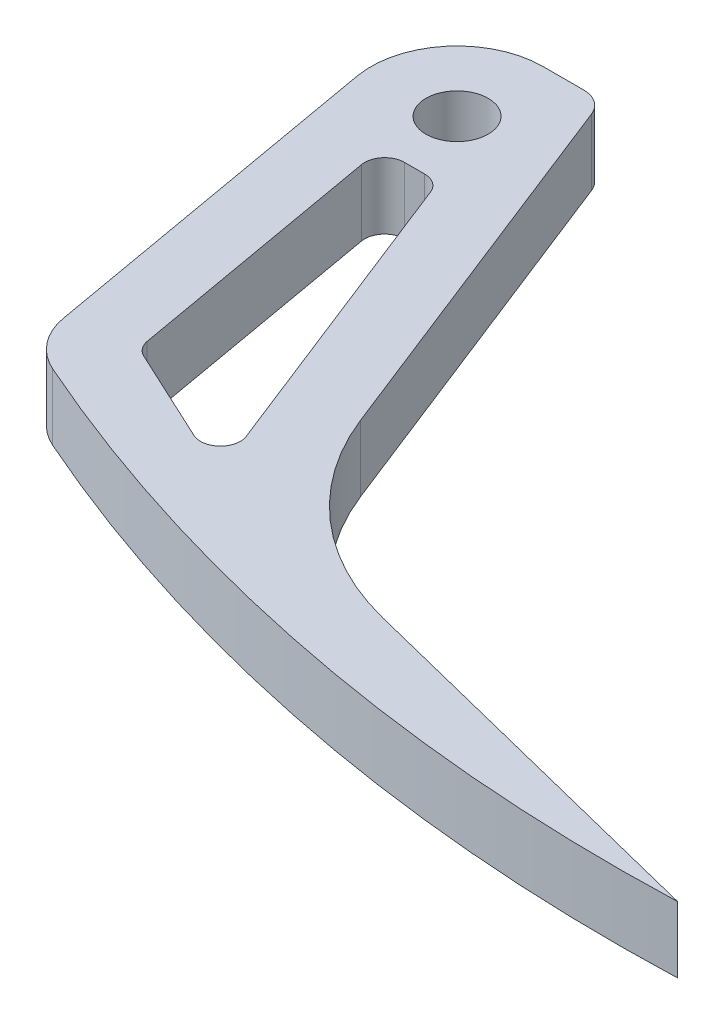
ISO-10303-21;
HEADER;
FILE_DESCRIPTION(('STEP AP214'),'2;1');
FILE_NAME('part.step','',(''),(''),'','','');
FILE_SCHEMA(('AUTOMOTIVE_DESIGN { 1 0 10303 214 1 1 1 1 }'));
ENDSEC;
DATA;
#1=APPLICATION_CONTEXT('core data for automotive mechanical design processes');
#2=APPLICATION_PROTOCOL_DEFINITION('international standard','automotive_design',2000,#1);
#3=PRODUCT_CONTEXT('',#1,'mechanical');
#4=PRODUCT('Part','Part','',(#3));
#5=PRODUCT_RELATED_PRODUCT_CATEGORY('part','',(#4));
#6=PRODUCT_DEFINITION_FORMATION('','',#4);
#7=PRODUCT_DEFINITION_CONTEXT('part definition',#1,'design');
#8=PRODUCT_DEFINITION('design','',#6,#7);
#9=PRODUCT_DEFINITION_SHAPE('','',#8);
#10=(LENGTH_UNIT() NAMED_UNIT(*) SI_UNIT(.MILLI.,.METRE.));
#11=(NAMED_UNIT(*) PLANE_ANGLE_UNIT() SI_UNIT($,.RADIAN.));
#12=(NAMED_UNIT(*) SI_UNIT($,.STERADIAN.) SOLID_ANGLE_UNIT());
#13=UNCERTAINTY_MEASURE_WITH_UNIT(LENGTH_MEASURE(1.E-05),#10,'distance_accuracy_value','');
#14=(GEOMETRIC_REPRESENTATION_CONTEXT(3) GLOBAL_UNCERTAINTY_ASSIGNED_CONTEXT((#13)) GLOBAL_UNIT_ASSIGNED_CONTEXT((#10,
#11,#12)) REPRESENTATION_CONTEXT('',''));
#15=CARTESIAN_POINT('',(0.,0.,0.));
#16=DIRECTION('',(0.,0.,1.));
#17=DIRECTION('',(1.,0.,0.));
#18=AXIS2_PLACEMENT_3D('',#15,#16,#17);
#19=CARTESIAN_POINT('',(7.68240809314638,6.35,-3.02086591730899));
#20=DIRECTION('',(0.930636958588295,0.,-0.365943781624348));
#21=DIRECTION('',(-0.365943781624348,0.,-0.930636958588295));
#22=AXIS2_PLACEMENT_3D('',#19,#20,#21);
#23=PLANE('',#22);
#24=DIRECTION('',(0.365943781624348,0.,0.930636958588295));
#25=VECTOR('',#24,1.);
#26=CARTESIAN_POINT('',(7.68240809314638,0.,-3.02086591730899));
#27=LINE('',#26,#25);
#28=CARTESIAN_POINT('',(6.25752879460584,0.,-6.64449720532584));
#29=VERTEX_POINT('',#28);
#30=CARTESIAN_POINT('',(20.6129718324001,0.,29.863038975722));
#31=VERTEX_POINT('',#30);
#32=EDGE_CURVE('E196',#29,#31,#27,.T.);
#33=ORIENTED_EDGE('',*,*,#32,.F.);
#34=DIRECTION('',(0.,-1.,0.));
#35=VECTOR('',#34,1.);
#36=CARTESIAN_POINT('',(6.25752879460584,6.35,-6.64449720532584));
#37=LINE('',#36,#35);
#38=CARTESIAN_POINT('',(6.25752879460584,6.35,-6.64449720532584));
#39=VERTEX_POINT('',#38);
#40=EDGE_CURVE('E46',#29,#39,#37,.F.);
#41=ORIENTED_EDGE('',*,*,#40,.T.);
#42=DIRECTION('',(0.365943781624348,0.,0.930636958588295));
#43=VECTOR('',#42,1.);
#44=CARTESIAN_POINT('',(7.68240809314638,6.35,-3.02086591730899));
#45=LINE('',#44,#43);
#46=CARTESIAN_POINT('',(20.6129718324001,6.35,29.863038975722));
#47=VERTEX_POINT('',#46);
#48=EDGE_CURVE('E180',#39,#47,#45,.T.);
#49=ORIENTED_EDGE('',*,*,#48,.T.);
#50=DIRECTION('',(0.,-1.,0.));
#51=VECTOR('',#50,1.);
#52=CARTESIAN_POINT('',(20.6129718324001,0.,29.863038975722));
#53=LINE('',#52,#51);
#54=EDGE_CURVE('E165',#47,#31,#53,.T.);
#55=ORIENTED_EDGE('',*,*,#54,.T.);
#56=EDGE_LOOP('',(#33,#41,#49,#55));
#57=FACE_BOUND('',#56,.T.);
#58=ADVANCED_FACE('F38',(#57),#23,.T.);
#59=CARTESIAN_POINT('',(0.,6.35,-8.255));
#60=DIRECTION('',(0.,0.,-1.));
#61=DIRECTION('',(-1.,0.,0.));
#62=AXIS2_PLACEMENT_3D('',#59,#60,#61);
#63=PLANE('',#62);
#64=DIRECTION('',(1.,0.,0.));
#65=VECTOR('',#64,1.);
#66=CARTESIAN_POINT('',(0.,6.35,-8.255));
#67=LINE('',#66,#65);
#68=CARTESIAN_POINT('',(0.,6.35,-8.255));
#69=VERTEX_POINT('',#68);
#70=CARTESIAN_POINT('',(3.89371091979157,6.35,-8.255));
#71=VERTEX_POINT('',#70);
#72=EDGE_CURVE('E160',#69,#71,#67,.T.);
#73=ORIENTED_EDGE('',*,*,#72,.T.);
#74=DIRECTION('',(0.,-1.,0.));
#75=VECTOR('',#74,1.);
#76=CARTESIAN_POINT('',(3.89371091979157,6.35,-8.255));
#77=LINE('',#76,#75);
#78=CARTESIAN_POINT('',(3.89371091979157,0.,-8.255));
#79=VERTEX_POINT('',#78);
#80=EDGE_CURVE('E269',#71,#79,#77,.T.);
#81=ORIENTED_EDGE('',*,*,#80,.T.);
#82=DIRECTION('',(1.,0.,0.));
#83=VECTOR('',#82,1.);
#84=CARTESIAN_POINT('',(0.,0.,-8.255));
#85=LINE('',#84,#83);
#86=CARTESIAN_POINT('',(0.,0.,-8.255));
#87=VERTEX_POINT('',#86);
#88=EDGE_CURVE('E162',#87,#79,#85,.T.);
#89=ORIENTED_EDGE('',*,*,#88,.F.);
#90=DIRECTION('',(0.,-1.,0.));
#91=VECTOR('',#90,1.);
#92=CARTESIAN_POINT('',(0.,6.35,-8.255));
#93=LINE('',#92,#91);
#94=EDGE_CURVE('E155',#69,#87,#93,.T.);
#95=ORIENTED_EDGE('',*,*,#94,.F.);
#96=EDGE_LOOP('',(#73,#81,#89,#95));
#97=FACE_BOUND('',#96,.T.);
#98=ADVANCED_FACE('F157',(#97),#63,.T.);
#99=CARTESIAN_POINT('',(0.,6.35,0.));
#100=DIRECTION('',(0.,-1.,0.));
#101=DIRECTION('',(0.,0.,-1.));
#102=AXIS2_PLACEMENT_3D('',#99,#100,#101);
#103=CYLINDRICAL_SURFACE('',#102,8.255);
#104=CARTESIAN_POINT('',(0.,0.,0.));
#105=DIRECTION('',(0.,1.,0.));
#106=DIRECTION('',(0.,0.,1.));
#107=AXIS2_PLACEMENT_3D('',#104,#105,#106);
#108=CIRCLE('',#107,8.255);
#109=CARTESIAN_POINT('',(-8.12958800111578,0.,1.43346570664052));
#110=VERTEX_POINT('',#109);
#111=EDGE_CURVE('E200',#87,#110,#108,.T.);
#112=ORIENTED_EDGE('',*,*,#111,.T.);
#113=DIRECTION('',(0.,-1.,0.));
#114=VECTOR('',#113,1.);
#115=CARTESIAN_POINT('',(-8.12958800111578,6.35,1.43346570664052));
#116=LINE('',#115,#114);
#117=CARTESIAN_POINT('',(-8.12958800111578,6.35,1.43346570664052));
#118=VERTEX_POINT('',#117);
#119=EDGE_CURVE('E166',#118,#110,#116,.T.);
#120=ORIENTED_EDGE('',*,*,#119,.F.);
#121=CARTESIAN_POINT('',(0.,6.35,0.));
#122=DIRECTION('',(0.,1.,0.));
#123=DIRECTION('',(0.,0.,1.));
#124=AXIS2_PLACEMENT_3D('',#121,#122,#123);
#125=CIRCLE('',#124,8.255);
#126=EDGE_CURVE('E169',#69,#118,#125,.T.);
#127=ORIENTED_EDGE('',*,*,#126,.F.);
#128=ORIENTED_EDGE('',*,*,#94,.T.);
#129=EDGE_LOOP('',(#112,#120,#127,#128));
#130=FACE_BOUND('',#129,.T.);
#131=ADVANCED_FACE('F170',(#130),#103,.T.);
#132=CARTESIAN_POINT('',(-8.12958800111578,6.35,1.43346570664052));
#133=DIRECTION('',(0.984807753012208,0.,-0.173648177666931));
#134=DIRECTION('',(-0.173648177666931,0.,-0.984807753012208));
#135=AXIS2_PLACEMENT_3D('',#132,#133,#134);
#136=PLANE('',#135);
#137=DIRECTION('',(0.173648177666931,0.,0.984807753012208));
#138=VECTOR('',#137,1.);
#139=CARTESIAN_POINT('',(-8.12958800111578,0.,1.43346570664052));
#140=LINE('',#139,#138);
#141=CARTESIAN_POINT('',(-2.09535075071062,0.,35.655325720123));
#142=VERTEX_POINT('',#141);
#143=EDGE_CURVE('E202',#110,#142,#140,.T.);
#144=ORIENTED_EDGE('',*,*,#143,.T.);
#145=DIRECTION('',(0.,-1.,0.));
#146=VECTOR('',#145,1.);
#147=CARTESIAN_POINT('',(-2.09535075071062,6.35,35.655325720123));
#148=LINE('',#147,#146);
#149=CARTESIAN_POINT('',(-2.09535075071062,6.35,35.655325720123));
#150=VERTEX_POINT('',#149);
#151=EDGE_CURVE('E229',#142,#150,#148,.F.);
#152=ORIENTED_EDGE('',*,*,#151,.T.);
#153=DIRECTION('',(0.173648177666931,0.,0.984807753012208));
#154=VECTOR('',#153,1.);
#155=CARTESIAN_POINT('',(-8.12958800111578,6.35,1.43346570664052));
#156=LINE('',#155,#154);
#157=EDGE_CURVE('E175',#118,#150,#156,.T.);
#158=ORIENTED_EDGE('',*,*,#157,.F.);
#159=ORIENTED_EDGE('',*,*,#119,.T.);
#160=EDGE_LOOP('',(#144,#152,#158,#159));
#161=FACE_BOUND('',#160,.T.);
#162=ADVANCED_FACE('F276',(#161),#136,.F.);
#163=CARTESIAN_POINT('',(69.85,6.35,-114.497688236202));
#164=DIRECTION('',(0.,-1.,0.));
#165=DIRECTION('',(0.,0.,-1.));
#166=AXIS2_PLACEMENT_3D('',#163,#164,#165);
#167=CYLINDRICAL_SURFACE('',#166,169.234688236202);
#168=CARTESIAN_POINT('',(69.85,6.35,-114.497688236202));
#169=DIRECTION('',(0.,1.,0.));
#170=DIRECTION('',(0.,0.,1.));
#171=AXIS2_PLACEMENT_3D('',#168,#169,#170);
#172=CIRCLE('',#171,169.234688236202);
#173=CARTESIAN_POINT('',(1.59720684409079,6.35,40.3633330984811));
#174=VERTEX_POINT('',#173);
#175=CARTESIAN_POINT('',(75.7837681621002,6.35,54.632942040525));
#176=VERTEX_POINT('',#175);
#177=EDGE_CURVE('E187',#174,#176,#172,.T.);
#178=ORIENTED_EDGE('',*,*,#177,.F.);
#179=DIRECTION('',(0.,-1.,0.));
#180=VECTOR('',#179,1.);
#181=CARTESIAN_POINT('',(1.59720684409079,6.35,40.3633330984811));
#182=LINE('',#181,#180);
#183=CARTESIAN_POINT('',(1.59720684409079,0.,40.3633330984811));
#184=VERTEX_POINT('',#183);
#185=EDGE_CURVE('E224',#174,#184,#182,.T.);
#186=ORIENTED_EDGE('',*,*,#185,.T.);
#187=CARTESIAN_POINT('',(69.85,0.,-114.497688236202));
#188=DIRECTION('',(0.,1.,0.));
#189=DIRECTION('',(0.,0.,1.));
#190=AXIS2_PLACEMENT_3D('',#187,#188,#189);
#191=CIRCLE('',#190,169.234688236202);
#192=CARTESIAN_POINT('',(75.7837681621002,0.,54.632942040525));
#193=VERTEX_POINT('',#192);
#194=EDGE_CURVE('E205',#184,#193,#191,.T.);
#195=ORIENTED_EDGE('',*,*,#194,.T.);
#196=DIRECTION('',(0.,-1.,0.));
#197=VECTOR('',#196,1.);
#198=CARTESIAN_POINT('',(75.7837681621002,6.35,54.632942040525));
#199=LINE('',#198,#197);
#200=EDGE_CURVE('E195',#176,#193,#199,.T.);
#201=ORIENTED_EDGE('',*,*,#200,.F.);
#202=EDGE_LOOP('',(#178,#186,#195,#201));
#203=FACE_BOUND('',#202,.T.);
#204=ADVANCED_FACE('F285',(#203),#167,.T.);
#205=CARTESIAN_POINT('',(-8.39694117647059,6.35,33.5877647058823));
#206=DIRECTION('',(0.242535625036333,0.,-0.970142500145332));
#207=DIRECTION('',(-0.970142500145332,0.,-0.242535625036333));
#208=AXIS2_PLACEMENT_3D('',#205,#206,#207);
#209=PLANE('',#208);
#210=DIRECTION('',(0.970142500145332,0.,0.242535625036333));
#211=VECTOR('',#210,1.);
#212=CARTESIAN_POINT('',(-8.39694117647059,0.,33.5877647058823));
#213=LINE('',#212,#211);
#214=CARTESIAN_POINT('',(38.0907457046199,0.,45.209686426155));
#215=VERTEX_POINT('',#214);
#216=EDGE_CURVE('E207',#215,#193,#213,.T.);
#217=ORIENTED_EDGE('',*,*,#216,.F.);
#218=DIRECTION('',(0.,-1.,0.));
#219=VECTOR('',#218,1.);
#220=CARTESIAN_POINT('',(38.0907457046199,6.35,45.209686426155));
#221=LINE('',#220,#219);
#222=CARTESIAN_POINT('',(38.0907457046199,6.35,45.209686426155));
#223=VERTEX_POINT('',#222);
#224=EDGE_CURVE('E217',#215,#223,#221,.F.);
#225=ORIENTED_EDGE('',*,*,#224,.T.);
#226=DIRECTION('',(0.970142500145332,0.,0.242535625036333));
#227=VECTOR('',#226,1.);
#228=CARTESIAN_POINT('',(-8.39694117647059,6.35,33.5877647058823));
#229=LINE('',#228,#227);
#230=EDGE_CURVE('E189',#223,#176,#229,.T.);
#231=ORIENTED_EDGE('',*,*,#230,.T.);
#232=ORIENTED_EDGE('',*,*,#200,.T.);
#233=EDGE_LOOP('',(#217,#225,#231,#232));
#234=FACE_BOUND('',#233,.T.);
#235=ADVANCED_FACE('F291',(#234),#209,.T.);
#236=CARTESIAN_POINT('',(0.,6.35,0.));
#237=DIRECTION('',(0.,-1.,0.));
#238=DIRECTION('',(0.,0.,-1.));
#239=AXIS2_PLACEMENT_3D('',#236,#237,#238);
#240=CYLINDRICAL_SURFACE('',#239,2.9845);
#241=CARTESIAN_POINT('',(0.,6.35,0.));
#242=DIRECTION('',(0.,1.,0.));
#243=DIRECTION('',(0.,0.,1.));
#244=AXIS2_PLACEMENT_3D('',#241,#242,#243);
#245=CIRCLE('',#244,2.9845);
#246=CARTESIAN_POINT('',(0.,6.35,2.9845));
#247=VERTEX_POINT('',#246);
#248=EDGE_CURVE('E192',#247,#247,#245,.T.);
#249=ORIENTED_EDGE('',*,*,#248,.T.);
#250=EDGE_LOOP('',(#249));
#251=FACE_BOUND('',#250,.T.);
#252=CARTESIAN_POINT('',(0.,0.,0.));
#253=DIRECTION('',(0.,1.,0.));
#254=DIRECTION('',(0.,0.,1.));
#255=AXIS2_PLACEMENT_3D('',#252,#253,#254);
#256=CIRCLE('',#255,2.9845);
#257=CARTESIAN_POINT('',(0.,0.,2.9845));
#258=VERTEX_POINT('',#257);
#259=EDGE_CURVE('E182',#258,#258,#256,.T.);
#260=ORIENTED_EDGE('',*,*,#259,.F.);
#261=EDGE_LOOP('',(#260));
#262=FACE_BOUND('',#261,.T.);
#263=ADVANCED_FACE('F392',(#251,#262),#240,.F.);
#264=CARTESIAN_POINT('',(0.,6.35,0.));
#265=DIRECTION('',(0.,1.,0.));
#266=DIRECTION('',(0.,0.,1.));
#267=AXIS2_PLACEMENT_3D('',#264,#265,#266);
#268=PLANE('',#267);
#269=DIRECTION('',(-1.,0.,0.));
#270=VECTOR('',#269,1.);
#271=CARTESIAN_POINT('',(-0.959630389308041,6.35,6.35));
#272=LINE('',#271,#270);
#273=CARTESIAN_POINT('',(3.24601971738949,6.35,6.35));
#274=VERTEX_POINT('',#273);
#275=CARTESIAN_POINT('',(1.31066020458393,6.35,6.35));
#276=VERTEX_POINT('',#275);
#277=EDGE_CURVE('E356',#274,#276,#272,.T.);
#278=ORIENTED_EDGE('',*,*,#277,.F.);
#279=CARTESIAN_POINT('',(3.24601971738949,6.35,8.255));
#280=DIRECTION('',(0.,1.,0.));
#281=DIRECTION('',(0.,0.,1.));
#282=AXIS2_PLACEMENT_3D('',#279,#280,#281);
#283=CIRCLE('',#282,1.905);
#284=CARTESIAN_POINT('',(5.01888312350019,6.35,7.55787709600561));
#285=VERTEX_POINT('',#284);
#286=EDGE_CURVE('E261',#274,#285,#283,.F.);
#287=ORIENTED_EDGE('',*,*,#286,.T.);
#288=DIRECTION('',(-0.365943781624347,0.,-0.930636958588295));
#289=VECTOR('',#288,1.);
#290=CARTESIAN_POINT('',(18.2194732646305,6.35,41.1284900627893));
#291=LINE('',#290,#289);
#292=CARTESIAN_POINT('',(16.4762487518267,6.35,36.695270425797));
#293=VERTEX_POINT('',#292);
#294=EDGE_CURVE('E346',#293,#285,#291,.T.);
#295=ORIENTED_EDGE('',*,*,#294,.F.);
#296=CARTESIAN_POINT('',(14.703385345716,6.35,37.3923933297914));
#297=DIRECTION('',(0.,1.,0.));
#298=DIRECTION('',(0.,0.,1.));
#299=AXIS2_PLACEMENT_3D('',#296,#297,#298);
#300=CIRCLE('',#299,1.905);
#301=CARTESIAN_POINT('',(13.9000769637298,6.35,39.1197382992259));
#302=VERTEX_POINT('',#301);
#303=EDGE_CURVE('E257',#293,#302,#300,.F.);
#304=ORIENTED_EDGE('',*,*,#303,.T.);
#305=DIRECTION('',(0.906742766107343,0.,0.421684190019028));
#306=VECTOR('',#305,1.);
#307=CARTESIAN_POINT('',(4.00733890228918,6.35,34.5190826420346));
#308=LINE('',#307,#306);
#309=CARTESIAN_POINT('',(4.9076691571025,6.35,34.9377846691602));
#310=VERTEX_POINT('',#309);
#311=EDGE_CURVE('E352',#310,#302,#308,.T.);
#312=ORIENTED_EDGE('',*,*,#311,.F.);
#313=CARTESIAN_POINT('',(5.71097753908875,6.35,33.2104396997257));
#314=DIRECTION('',(0.,1.,0.));
#315=DIRECTION('',(0.,0.,1.));
#316=AXIS2_PLACEMENT_3D('',#313,#314,#315);
#317=CIRCLE('',#316,1.905);
#318=CARTESIAN_POINT('',(3.83491876960049,6.35,33.5412394781812));
#319=VERTEX_POINT('',#318);
#320=EDGE_CURVE('E253',#310,#319,#317,.F.);
#321=ORIENTED_EDGE('',*,*,#320,.T.);
#322=DIRECTION('',(0.173648177666931,0.,0.984807753012208));
#323=VECTOR('',#322,1.);
#324=CARTESIAN_POINT('',(4.00733890228918,6.35,34.5190826420346));
#325=LINE('',#324,#323);
#326=CARTESIAN_POINT('',(-0.565398564904325,6.35,8.5857997784555));
#327=VERTEX_POINT('',#326);
#328=EDGE_CURVE('E358',#327,#319,#325,.T.);
#329=ORIENTED_EDGE('',*,*,#328,.F.);
#330=CARTESIAN_POINT('',(1.31066020458393,6.35,8.255));
#331=DIRECTION('',(0.,1.,0.));
#332=DIRECTION('',(0.,0.,1.));
#333=AXIS2_PLACEMENT_3D('',#330,#331,#332);
#334=CIRCLE('',#333,1.905);
#335=EDGE_CURVE('E265',#327,#276,#334,.F.);
#336=ORIENTED_EDGE('',*,*,#335,.T.);
#337=EDGE_LOOP('',(#278,#287,#295,#304,#312,#321,#329,#336));
#338=FACE_BOUND('',#337,.T.);
#339=ORIENTED_EDGE('',*,*,#48,.F.);
#340=CARTESIAN_POINT('',(3.89371091979157,6.35,-5.715));
#341=DIRECTION('',(0.,1.,0.));
#342=DIRECTION('',(0.,0.,1.));
#343=AXIS2_PLACEMENT_3D('',#340,#341,#342);
#344=CIRCLE('',#343,2.54);
#345=EDGE_CURVE('E11',#39,#71,#344,.T.);
#346=ORIENTED_EDGE('',*,*,#345,.T.);
#347=ORIENTED_EDGE('',*,*,#72,.F.);
#348=ORIENTED_EDGE('',*,*,#126,.T.);
#349=ORIENTED_EDGE('',*,*,#157,.T.);
#350=CARTESIAN_POINT('',(4.15817848091691,6.35,34.552659791938));
#351=DIRECTION('',(0.,1.,0.));
#352=DIRECTION('',(0.,0.,1.));
#353=AXIS2_PLACEMENT_3D('',#350,#351,#352);
#354=CIRCLE('',#353,6.35);
#355=EDGE_CURVE('E231',#150,#174,#354,.T.);
#356=ORIENTED_EDGE('',*,*,#355,.T.);
#357=ORIENTED_EDGE('',*,*,#177,.T.);
#358=ORIENTED_EDGE('',*,*,#230,.F.);
#359=CARTESIAN_POINT('',(44.2511505805427,6.35,20.5680669224635));
#360=DIRECTION('',(0.,1.,0.));
#361=DIRECTION('',(0.,0.,1.));
#362=AXIS2_PLACEMENT_3D('',#359,#360,#361);
#363=CIRCLE('',#362,25.4);
#364=EDGE_CURVE('E221',#223,#47,#363,.F.);
#365=ORIENTED_EDGE('',*,*,#364,.T.);
#366=EDGE_LOOP('',(#339,#346,#347,#348,#349,#356,#357,#358,#365));
#367=FACE_BOUND('',#366,.T.);
#368=ORIENTED_EDGE('',*,*,#248,.F.);
#369=EDGE_LOOP('',(#368));
#370=FACE_BOUND('',#369,.T.);
#371=ADVANCED_FACE('F177',(#338,#367,#370),#268,.T.);
#372=CARTESIAN_POINT('',(0.,0.,0.));
#373=DIRECTION('',(0.,1.,0.));
#374=DIRECTION('',(0.,0.,1.));
#375=AXIS2_PLACEMENT_3D('',#372,#373,#374);
#376=PLANE('',#375);
#377=DIRECTION('',(0.906742766107343,0.,0.421684190019028));
#378=VECTOR('',#377,1.);
#379=CARTESIAN_POINT('',(4.00733890228918,0.,34.5190826420346));
#380=LINE('',#379,#378);
#381=CARTESIAN_POINT('',(4.9076691571025,0.,34.9377846691602));
#382=VERTEX_POINT('',#381);
#383=CARTESIAN_POINT('',(13.9000769637298,0.,39.1197382992259));
#384=VERTEX_POINT('',#383);
#385=EDGE_CURVE('E349',#382,#384,#380,.T.);
#386=ORIENTED_EDGE('',*,*,#385,.T.);
#387=CARTESIAN_POINT('',(14.703385345716,0.,37.3923933297914));
#388=DIRECTION('',(0.,1.,0.));
#389=DIRECTION('',(0.,0.,1.));
#390=AXIS2_PLACEMENT_3D('',#387,#388,#389);
#391=CIRCLE('',#390,1.905);
#392=CARTESIAN_POINT('',(16.4762487518267,0.,36.695270425797));
#393=VERTEX_POINT('',#392);
#394=EDGE_CURVE('E259',#384,#393,#391,.T.);
#395=ORIENTED_EDGE('',*,*,#394,.T.);
#396=DIRECTION('',(-0.365943781624347,0.,-0.930636958588295));
#397=VECTOR('',#396,1.);
#398=CARTESIAN_POINT('',(18.2194732646305,0.,41.1284900627893));
#399=LINE('',#398,#397);
#400=CARTESIAN_POINT('',(5.01888312350019,0.,7.55787709600561));
#401=VERTEX_POINT('',#400);
#402=EDGE_CURVE('E198',#393,#401,#399,.T.);
#403=ORIENTED_EDGE('',*,*,#402,.T.);
#404=CARTESIAN_POINT('',(3.24601971738949,0.,8.255));
#405=DIRECTION('',(0.,1.,0.));
#406=DIRECTION('',(0.,0.,1.));
#407=AXIS2_PLACEMENT_3D('',#404,#405,#406);
#408=CIRCLE('',#407,1.905);
#409=CARTESIAN_POINT('',(3.24601971738949,0.,6.35));
#410=VERTEX_POINT('',#409);
#411=EDGE_CURVE('E263',#401,#410,#408,.T.);
#412=ORIENTED_EDGE('',*,*,#411,.T.);
#413=DIRECTION('',(-1.,0.,0.));
#414=VECTOR('',#413,1.);
#415=CARTESIAN_POINT('',(-0.959630389308041,0.,6.35));
#416=LINE('',#415,#414);
#417=CARTESIAN_POINT('',(1.31066020458393,0.,6.35));
#418=VERTEX_POINT('',#417);
#419=EDGE_CURVE('E337',#410,#418,#416,.T.);
#420=ORIENTED_EDGE('',*,*,#419,.T.);
#421=CARTESIAN_POINT('',(1.31066020458393,0.,8.255));
#422=DIRECTION('',(0.,1.,0.));
#423=DIRECTION('',(0.,0.,1.));
#424=AXIS2_PLACEMENT_3D('',#421,#422,#423);
#425=CIRCLE('',#424,1.905);
#426=CARTESIAN_POINT('',(-0.565398564904325,0.,8.5857997784555));
#427=VERTEX_POINT('',#426);
#428=EDGE_CURVE('E267',#418,#427,#425,.T.);
#429=ORIENTED_EDGE('',*,*,#428,.T.);
#430=DIRECTION('',(0.173648177666931,0.,0.984807753012208));
#431=VECTOR('',#430,1.);
#432=CARTESIAN_POINT('',(4.00733890228918,0.,34.5190826420346));
#433=LINE('',#432,#431);
#434=CARTESIAN_POINT('',(3.83491876960049,0.,33.5412394781812));
#435=VERTEX_POINT('',#434);
#436=EDGE_CURVE('E345',#427,#435,#433,.T.);
#437=ORIENTED_EDGE('',*,*,#436,.T.);
#438=CARTESIAN_POINT('',(5.71097753908875,0.,33.2104396997257));
#439=DIRECTION('',(0.,1.,0.));
#440=DIRECTION('',(0.,0.,1.));
#441=AXIS2_PLACEMENT_3D('',#438,#439,#440);
#442=CIRCLE('',#441,1.905);
#443=EDGE_CURVE('E255',#435,#382,#442,.T.);
#444=ORIENTED_EDGE('',*,*,#443,.T.);
#445=EDGE_LOOP('',(#386,#395,#403,#412,#420,#429,#437,#444));
#446=FACE_BOUND('',#445,.T.);
#447=ORIENTED_EDGE('',*,*,#88,.T.);
#448=CARTESIAN_POINT('',(3.89371091979157,0.,-5.715));
#449=DIRECTION('',(0.,1.,0.));
#450=DIRECTION('',(0.,0.,1.));
#451=AXIS2_PLACEMENT_3D('',#448,#449,#450);
#452=CIRCLE('',#451,2.54);
#453=EDGE_CURVE('E60',#79,#29,#452,.F.);
#454=ORIENTED_EDGE('',*,*,#453,.T.);
#455=ORIENTED_EDGE('',*,*,#32,.T.);
#456=CARTESIAN_POINT('',(44.2511505805427,0.,20.5680669224635));
#457=DIRECTION('',(0.,1.,0.));
#458=DIRECTION('',(0.,0.,1.));
#459=AXIS2_PLACEMENT_3D('',#456,#457,#458);
#460=CIRCLE('',#459,25.4);
#461=EDGE_CURVE('E219',#31,#215,#460,.T.);
#462=ORIENTED_EDGE('',*,*,#461,.T.);
#463=ORIENTED_EDGE('',*,*,#216,.T.);
#464=ORIENTED_EDGE('',*,*,#194,.F.);
#465=CARTESIAN_POINT('',(4.15817848091691,0.,34.552659791938));
#466=DIRECTION('',(0.,1.,0.));
#467=DIRECTION('',(0.,0.,1.));
#468=AXIS2_PLACEMENT_3D('',#465,#466,#467);
#469=CIRCLE('',#468,6.35);
#470=EDGE_CURVE('E227',#184,#142,#469,.F.);
#471=ORIENTED_EDGE('',*,*,#470,.T.);
#472=ORIENTED_EDGE('',*,*,#143,.F.);
#473=ORIENTED_EDGE('',*,*,#111,.F.);
#474=EDGE_LOOP('',(#447,#454,#455,#462,#463,#464,#471,#472,#473));
#475=FACE_BOUND('',#474,.T.);
#476=ORIENTED_EDGE('',*,*,#259,.T.);
#477=EDGE_LOOP('',(#476));
#478=FACE_BOUND('',#477,.T.);
#479=ADVANCED_FACE('F272',(#446,#475,#478),#376,.F.);
#480=CARTESIAN_POINT('',(-0.959630389308041,0.,6.35));
#481=DIRECTION('',(0.,0.,-1.));
#482=DIRECTION('',(-1.,0.,0.));
#483=AXIS2_PLACEMENT_3D('',#480,#481,#482);
#484=PLANE('',#483);
#485=ORIENTED_EDGE('',*,*,#419,.F.);
#486=DIRECTION('',(0.,1.,0.));
#487=VECTOR('',#486,1.);
#488=CARTESIAN_POINT('',(3.24601971738949,6.35,6.35));
#489=LINE('',#488,#487);
#490=EDGE_CURVE('E250',#410,#274,#489,.T.);
#491=ORIENTED_EDGE('',*,*,#490,.T.);
#492=ORIENTED_EDGE('',*,*,#277,.T.);
#493=DIRECTION('',(0.,1.,0.));
#494=VECTOR('',#493,1.);
#495=CARTESIAN_POINT('',(1.31066020458393,0.,6.35));
#496=LINE('',#495,#494);
#497=EDGE_CURVE('E248',#276,#418,#496,.F.);
#498=ORIENTED_EDGE('',*,*,#497,.T.);
#499=EDGE_LOOP('',(#485,#491,#492,#498));
#500=FACE_BOUND('',#499,.T.);
#501=ADVANCED_FACE('F341',(#500),#484,.F.);
#502=CARTESIAN_POINT('',(18.2194732646305,0.,41.1284900627893));
#503=DIRECTION('',(0.930636958588295,0.,-0.365943781624347));
#504=DIRECTION('',(-0.365943781624347,0.,-0.930636958588295));
#505=AXIS2_PLACEMENT_3D('',#502,#503,#504);
#506=PLANE('',#505);
#507=ORIENTED_EDGE('',*,*,#402,.F.);
#508=DIRECTION('',(0.,1.,0.));
#509=VECTOR('',#508,1.);
#510=CARTESIAN_POINT('',(16.4762487518267,6.35,36.695270425797));
#511=LINE('',#510,#509);
#512=EDGE_CURVE('E245',#393,#293,#511,.T.);
#513=ORIENTED_EDGE('',*,*,#512,.T.);
#514=ORIENTED_EDGE('',*,*,#294,.T.);
#515=DIRECTION('',(0.,1.,0.));
#516=VECTOR('',#515,1.);
#517=CARTESIAN_POINT('',(5.01888312350019,0.,7.55787709600562));
#518=LINE('',#517,#516);
#519=EDGE_CURVE('E243',#285,#401,#518,.F.);
#520=ORIENTED_EDGE('',*,*,#519,.T.);
#521=EDGE_LOOP('',(#507,#513,#514,#520));
#522=FACE_BOUND('',#521,.T.);
#523=ADVANCED_FACE('F372',(#522),#506,.F.);
#524=CARTESIAN_POINT('',(4.00733890228918,0.,34.5190826420346));
#525=DIRECTION('',(-0.421684190019028,0.,0.906742766107343));
#526=DIRECTION('',(0.906742766107343,0.,0.421684190019028));
#527=AXIS2_PLACEMENT_3D('',#524,#525,#526);
#528=PLANE('',#527);
#529=ORIENTED_EDGE('',*,*,#385,.F.);
#530=DIRECTION('',(0.,1.,0.));
#531=VECTOR('',#530,1.);
#532=CARTESIAN_POINT('',(4.9076691571025,6.35,34.9377846691602));
#533=LINE('',#532,#531);
#534=EDGE_CURVE('E235',#382,#310,#533,.T.);
#535=ORIENTED_EDGE('',*,*,#534,.T.);
#536=ORIENTED_EDGE('',*,*,#311,.T.);
#537=DIRECTION('',(0.,1.,0.));
#538=VECTOR('',#537,1.);
#539=CARTESIAN_POINT('',(13.9000769637298,0.,39.1197382992259));
#540=LINE('',#539,#538);
#541=EDGE_CURVE('E233',#302,#384,#540,.F.);
#542=ORIENTED_EDGE('',*,*,#541,.T.);
#543=EDGE_LOOP('',(#529,#535,#536,#542));
#544=FACE_BOUND('',#543,.T.);
#545=ADVANCED_FACE('F366',(#544),#528,.F.);
#546=CARTESIAN_POINT('',(4.00733890228918,0.,34.5190826420346));
#547=DIRECTION('',(-0.984807753012208,0.,0.173648177666931));
#548=DIRECTION('',(0.173648177666931,0.,0.984807753012208));
#549=AXIS2_PLACEMENT_3D('',#546,#547,#548);
#550=PLANE('',#549);
#551=ORIENTED_EDGE('',*,*,#328,.T.);
#552=DIRECTION('',(0.,1.,0.));
#553=VECTOR('',#552,1.);
#554=CARTESIAN_POINT('',(3.83491876960049,0.,33.5412394781812));
#555=LINE('',#554,#553);
#556=EDGE_CURVE('E241',#319,#435,#555,.F.);
#557=ORIENTED_EDGE('',*,*,#556,.T.);
#558=ORIENTED_EDGE('',*,*,#436,.F.);
#559=DIRECTION('',(0.,1.,0.));
#560=VECTOR('',#559,1.);
#561=CARTESIAN_POINT('',(-0.565398564904325,6.35,8.5857997784555));
#562=LINE('',#561,#560);
#563=EDGE_CURVE('E238',#427,#327,#562,.T.);
#564=ORIENTED_EDGE('',*,*,#563,.T.);
#565=EDGE_LOOP('',(#551,#557,#558,#564));
#566=FACE_BOUND('',#565,.T.);
#567=ADVANCED_FACE('F314',(#566),#550,.F.);
#568=CARTESIAN_POINT('',(44.2511505805427,6.35,20.5680669224635));
#569=DIRECTION('',(0.,1.,0.));
#570=DIRECTION('',(0.,0.,1.));
#571=AXIS2_PLACEMENT_3D('',#568,#569,#570);
#572=CYLINDRICAL_SURFACE('',#571,25.4);
#573=ORIENTED_EDGE('',*,*,#364,.F.);
#574=ORIENTED_EDGE('',*,*,#224,.F.);
#575=ORIENTED_EDGE('',*,*,#461,.F.);
#576=ORIENTED_EDGE('',*,*,#54,.F.);
#577=EDGE_LOOP('',(#573,#574,#575,#576));
#578=FACE_BOUND('',#577,.T.);
#579=ADVANCED_FACE('F296',(#578),#572,.F.);
#580=CARTESIAN_POINT('',(4.15817848091691,6.35,34.552659791938));
#581=DIRECTION('',(0.,-1.,0.));
#582=DIRECTION('',(0.,0.,-1.));
#583=AXIS2_PLACEMENT_3D('',#580,#581,#582);
#584=CYLINDRICAL_SURFACE('',#583,6.35);
#585=ORIENTED_EDGE('',*,*,#355,.F.);
#586=ORIENTED_EDGE('',*,*,#151,.F.);
#587=ORIENTED_EDGE('',*,*,#470,.F.);
#588=ORIENTED_EDGE('',*,*,#185,.F.);
#589=EDGE_LOOP('',(#585,#586,#587,#588));
#590=FACE_BOUND('',#589,.T.);
#591=ADVANCED_FACE('F282',(#590),#584,.T.);
#592=CARTESIAN_POINT('',(5.71097753908875,0.,33.2104396997257));
#593=DIRECTION('',(0.,-1.,0.));
#594=DIRECTION('',(0.,0.,-1.));
#595=AXIS2_PLACEMENT_3D('',#592,#593,#594);
#596=CYLINDRICAL_SURFACE('',#595,1.905);
#597=ORIENTED_EDGE('',*,*,#443,.F.);
#598=ORIENTED_EDGE('',*,*,#556,.F.);
#599=ORIENTED_EDGE('',*,*,#320,.F.);
#600=ORIENTED_EDGE('',*,*,#534,.F.);
#601=EDGE_LOOP('',(#597,#598,#599,#600));
#602=FACE_BOUND('',#601,.T.);
#603=ADVANCED_FACE('F317',(#602),#596,.F.);
#604=CARTESIAN_POINT('',(14.703385345716,0.,37.3923933297914));
#605=DIRECTION('',(0.,-1.,0.));
#606=DIRECTION('',(0.,0.,-1.));
#607=AXIS2_PLACEMENT_3D('',#604,#605,#606);
#608=CYLINDRICAL_SURFACE('',#607,1.905);
#609=ORIENTED_EDGE('',*,*,#394,.F.);
#610=ORIENTED_EDGE('',*,*,#541,.F.);
#611=ORIENTED_EDGE('',*,*,#303,.F.);
#612=ORIENTED_EDGE('',*,*,#512,.F.);
#613=EDGE_LOOP('',(#609,#610,#611,#612));
#614=FACE_BOUND('',#613,.T.);
#615=ADVANCED_FACE('F320',(#614),#608,.F.);
#616=CARTESIAN_POINT('',(3.24601971738949,0.,8.255));
#617=DIRECTION('',(0.,-1.,0.));
#618=DIRECTION('',(0.,0.,-1.));
#619=AXIS2_PLACEMENT_3D('',#616,#617,#618);
#620=CYLINDRICAL_SURFACE('',#619,1.905);
#621=ORIENTED_EDGE('',*,*,#411,.F.);
#622=ORIENTED_EDGE('',*,*,#519,.F.);
#623=ORIENTED_EDGE('',*,*,#286,.F.);
#624=ORIENTED_EDGE('',*,*,#490,.F.);
#625=EDGE_LOOP('',(#621,#622,#623,#624));
#626=FACE_BOUND('',#625,.T.);
#627=ADVANCED_FACE('F302',(#626),#620,.F.);
#628=CARTESIAN_POINT('',(1.31066020458393,0.,8.255));
#629=DIRECTION('',(0.,-1.,0.));
#630=DIRECTION('',(0.,0.,-1.));
#631=AXIS2_PLACEMENT_3D('',#628,#629,#630);
#632=CYLINDRICAL_SURFACE('',#631,1.905);
#633=ORIENTED_EDGE('',*,*,#428,.F.);
#634=ORIENTED_EDGE('',*,*,#497,.F.);
#635=ORIENTED_EDGE('',*,*,#335,.F.);
#636=ORIENTED_EDGE('',*,*,#563,.F.);
#637=EDGE_LOOP('',(#633,#634,#635,#636));
#638=FACE_BOUND('',#637,.T.);
#639=ADVANCED_FACE('F298',(#638),#632,.F.);
#640=CARTESIAN_POINT('',(3.89371091979157,6.35,-5.715));
#641=DIRECTION('',(0.,-1.,0.));
#642=DIRECTION('',(0.,0.,-1.));
#643=AXIS2_PLACEMENT_3D('',#640,#641,#642);
#644=CYLINDRICAL_SURFACE('',#643,2.54);
#645=ORIENTED_EDGE('',*,*,#345,.F.);
#646=ORIENTED_EDGE('',*,*,#40,.F.);
#647=ORIENTED_EDGE('',*,*,#453,.F.);
#648=ORIENTED_EDGE('',*,*,#80,.F.);
#649=EDGE_LOOP('',(#645,#646,#647,#648));
#650=FACE_BOUND('',#649,.T.);
#651=ADVANCED_FACE('F40',(#650),#644,.T.);
#652=CLOSED_SHELL('',(#58,#98,#131,#162,#204,#235,#263,#371,#479,#501,#523,#545,#567,#579,#591,
#603,#615,#627,#639,#651));
#653=MANIFOLD_SOLID_BREP('B2',#652);
#654=ADVANCED_BREP_SHAPE_REPRESENTATION('',(#18,#653),#14);
#655=SHAPE_DEFINITION_REPRESENTATION(#9,#654);
ENDSEC;
END-ISO-10303-21;
